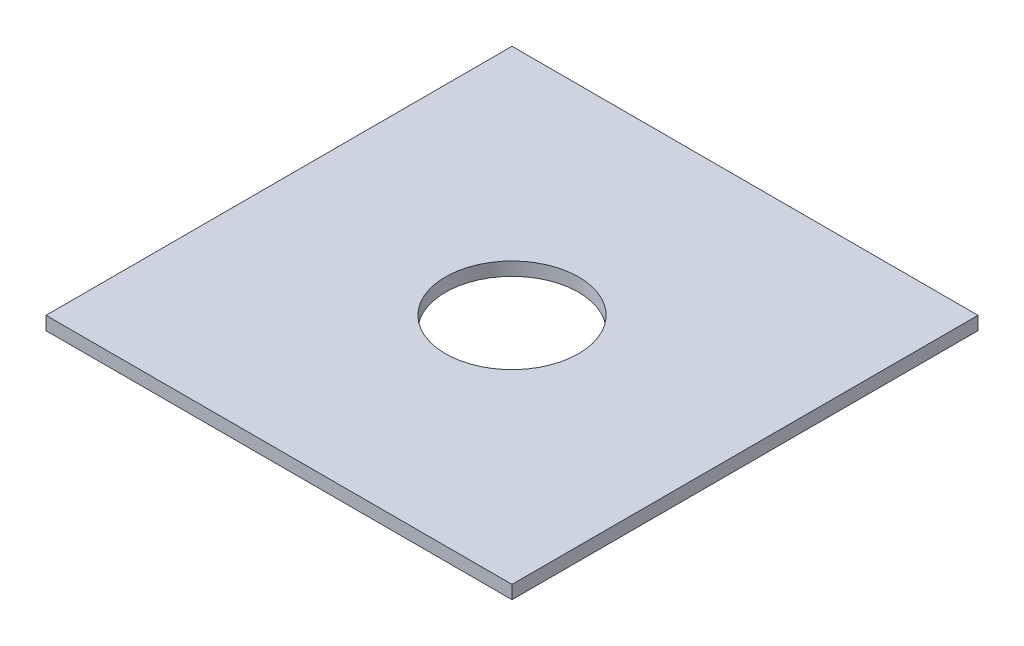
ISO-10303-21;
HEADER;
FILE_DESCRIPTION(('STEP AP214'),'2;1');
FILE_NAME('part.step','',(''),(''),'','','');
FILE_SCHEMA(('AUTOMOTIVE_DESIGN { 1 0 10303 214 1 1 1 1 }'));
ENDSEC;
DATA;
#1=APPLICATION_CONTEXT('core data for automotive mechanical design processes');
#2=APPLICATION_PROTOCOL_DEFINITION('international standard','automotive_design',2000,#1);
#3=PRODUCT_CONTEXT('',#1,'mechanical');
#4=PRODUCT('Part','Part','',(#3));
#5=PRODUCT_RELATED_PRODUCT_CATEGORY('part','',(#4));
#6=PRODUCT_DEFINITION_FORMATION('','',#4);
#7=PRODUCT_DEFINITION_CONTEXT('part definition',#1,'design');
#8=PRODUCT_DEFINITION('design','',#6,#7);
#9=PRODUCT_DEFINITION_SHAPE('','',#8);
#10=(LENGTH_UNIT() NAMED_UNIT(*) SI_UNIT(.MILLI.,.METRE.));
#11=(NAMED_UNIT(*) PLANE_ANGLE_UNIT() SI_UNIT($,.RADIAN.));
#12=(NAMED_UNIT(*) SI_UNIT($,.STERADIAN.) SOLID_ANGLE_UNIT());
#13=UNCERTAINTY_MEASURE_WITH_UNIT(LENGTH_MEASURE(1.E-05),#10,'distance_accuracy_value','');
#14=(GEOMETRIC_REPRESENTATION_CONTEXT(3) GLOBAL_UNCERTAINTY_ASSIGNED_CONTEXT((#13)) GLOBAL_UNIT_ASSIGNED_CONTEXT((#10,
#11,#12)) REPRESENTATION_CONTEXT('',''));
#15=CARTESIAN_POINT('',(0.,0.,0.));
#16=DIRECTION('',(0.,0.,1.));
#17=DIRECTION('',(1.,0.,0.));
#18=AXIS2_PLACEMENT_3D('',#15,#16,#17);
#19=CARTESIAN_POINT('',(0.,10.,0.));
#20=DIRECTION('',(1.,0.,0.));
#21=DIRECTION('',(0.,0.,-1.));
#22=AXIS2_PLACEMENT_3D('',#19,#20,#21);
#23=PLANE('',#22);
#24=DIRECTION('',(0.,0.,1.));
#25=VECTOR('',#24,1.);
#26=CARTESIAN_POINT('',(0.,0.,0.));
#27=LINE('',#26,#25);
#28=CARTESIAN_POINT('',(0.,0.,-350.));
#29=VERTEX_POINT('',#28);
#30=CARTESIAN_POINT('',(0.,0.,0.));
#31=VERTEX_POINT('',#30);
#32=EDGE_CURVE('E94',#29,#31,#27,.T.);
#33=ORIENTED_EDGE('',*,*,#32,.T.);
#34=DIRECTION('',(0.,-1.,0.));
#35=VECTOR('',#34,1.);
#36=CARTESIAN_POINT('',(0.,10.,0.));
#37=LINE('',#36,#35);
#38=CARTESIAN_POINT('',(0.,10.,0.));
#39=VERTEX_POINT('',#38);
#40=EDGE_CURVE('E11',#39,#31,#37,.T.);
#41=ORIENTED_EDGE('',*,*,#40,.F.);
#42=DIRECTION('',(0.,0.,1.));
#43=VECTOR('',#42,1.);
#44=CARTESIAN_POINT('',(0.,10.,0.));
#45=LINE('',#44,#43);
#46=CARTESIAN_POINT('',(0.,10.,-350.));
#47=VERTEX_POINT('',#46);
#48=EDGE_CURVE('E82',#47,#39,#45,.T.);
#49=ORIENTED_EDGE('',*,*,#48,.F.);
#50=DIRECTION('',(0.,-1.,0.));
#51=VECTOR('',#50,1.);
#52=CARTESIAN_POINT('',(0.,10.,-350.));
#53=LINE('',#52,#51);
#54=EDGE_CURVE('E90',#47,#29,#53,.T.);
#55=ORIENTED_EDGE('',*,*,#54,.T.);
#56=EDGE_LOOP('',(#33,#41,#49,#55));
#57=FACE_BOUND('',#56,.T.);
#58=ADVANCED_FACE('F31',(#57),#23,.F.);
#59=CARTESIAN_POINT('',(0.,10.,0.));
#60=DIRECTION('',(0.,0.,-1.));
#61=DIRECTION('',(-1.,0.,0.));
#62=AXIS2_PLACEMENT_3D('',#59,#60,#61);
#63=PLANE('',#62);
#64=DIRECTION('',(1.,0.,0.));
#65=VECTOR('',#64,1.);
#66=CARTESIAN_POINT('',(0.,0.,0.));
#67=LINE('',#66,#65);
#68=CARTESIAN_POINT('',(350.,0.,0.));
#69=VERTEX_POINT('',#68);
#70=EDGE_CURVE('E86',#31,#69,#67,.T.);
#71=ORIENTED_EDGE('',*,*,#70,.T.);
#72=DIRECTION('',(0.,-1.,0.));
#73=VECTOR('',#72,1.);
#74=CARTESIAN_POINT('',(350.,10.,0.));
#75=LINE('',#74,#73);
#76=CARTESIAN_POINT('',(350.,10.,0.));
#77=VERTEX_POINT('',#76);
#78=EDGE_CURVE('E39',#77,#69,#75,.T.);
#79=ORIENTED_EDGE('',*,*,#78,.F.);
#80=DIRECTION('',(1.,0.,0.));
#81=VECTOR('',#80,1.);
#82=CARTESIAN_POINT('',(0.,10.,0.));
#83=LINE('',#82,#81);
#84=EDGE_CURVE('E77',#39,#77,#83,.T.);
#85=ORIENTED_EDGE('',*,*,#84,.F.);
#86=ORIENTED_EDGE('',*,*,#40,.T.);
#87=EDGE_LOOP('',(#71,#79,#85,#86));
#88=FACE_BOUND('',#87,.T.);
#89=ADVANCED_FACE('F85',(#88),#63,.F.);
#90=CARTESIAN_POINT('',(350.,10.,0.));
#91=DIRECTION('',(-1.,0.,0.));
#92=DIRECTION('',(0.,0.,1.));
#93=AXIS2_PLACEMENT_3D('',#90,#91,#92);
#94=PLANE('',#93);
#95=DIRECTION('',(0.,0.,-1.));
#96=VECTOR('',#95,1.);
#97=CARTESIAN_POINT('',(350.,0.,0.));
#98=LINE('',#97,#96);
#99=CARTESIAN_POINT('',(350.,0.,-350.));
#100=VERTEX_POINT('',#99);
#101=EDGE_CURVE('E64',#69,#100,#98,.T.);
#102=ORIENTED_EDGE('',*,*,#101,.T.);
#103=DIRECTION('',(0.,-1.,0.));
#104=VECTOR('',#103,1.);
#105=CARTESIAN_POINT('',(350.,10.,-350.));
#106=LINE('',#105,#104);
#107=CARTESIAN_POINT('',(350.,10.,-350.));
#108=VERTEX_POINT('',#107);
#109=EDGE_CURVE('E87',#108,#100,#106,.T.);
#110=ORIENTED_EDGE('',*,*,#109,.F.);
#111=DIRECTION('',(0.,0.,-1.));
#112=VECTOR('',#111,1.);
#113=CARTESIAN_POINT('',(350.,10.,0.));
#114=LINE('',#113,#112);
#115=EDGE_CURVE('E80',#77,#108,#114,.T.);
#116=ORIENTED_EDGE('',*,*,#115,.F.);
#117=ORIENTED_EDGE('',*,*,#78,.T.);
#118=EDGE_LOOP('',(#102,#110,#116,#117));
#119=FACE_BOUND('',#118,.T.);
#120=ADVANCED_FACE('F88',(#119),#94,.F.);
#121=CARTESIAN_POINT('',(0.,10.,-350.));
#122=DIRECTION('',(0.,0.,1.));
#123=DIRECTION('',(1.,0.,0.));
#124=AXIS2_PLACEMENT_3D('',#121,#122,#123);
#125=PLANE('',#124);
#126=DIRECTION('',(-1.,0.,0.));
#127=VECTOR('',#126,1.);
#128=CARTESIAN_POINT('',(0.,0.,-350.));
#129=LINE('',#128,#127);
#130=EDGE_CURVE('E70',#100,#29,#129,.T.);
#131=ORIENTED_EDGE('',*,*,#130,.T.);
#132=ORIENTED_EDGE('',*,*,#54,.F.);
#133=DIRECTION('',(-1.,0.,0.));
#134=VECTOR('',#133,1.);
#135=CARTESIAN_POINT('',(0.,10.,-350.));
#136=LINE('',#135,#134);
#137=EDGE_CURVE('E47',#108,#47,#136,.T.);
#138=ORIENTED_EDGE('',*,*,#137,.F.);
#139=ORIENTED_EDGE('',*,*,#109,.T.);
#140=EDGE_LOOP('',(#131,#132,#138,#139));
#141=FACE_BOUND('',#140,.T.);
#142=ADVANCED_FACE('F102',(#141),#125,.F.);
#143=CARTESIAN_POINT('',(0.,10.,-350.));
#144=DIRECTION('',(0.,-1.,0.));
#145=DIRECTION('',(0.,0.,-1.));
#146=AXIS2_PLACEMENT_3D('',#143,#144,#145);
#147=PLANE('',#146);
#148=CARTESIAN_POINT('',(175.,10.,-175.));
#149=DIRECTION('',(0.,1.,0.));
#150=DIRECTION('',(1.,0.,0.));
#151=AXIS2_PLACEMENT_3D('',#148,#149,#150);
#152=CIRCLE('',#151,50.);
#153=CARTESIAN_POINT('',(225.,10.,-175.));
#154=VERTEX_POINT('',#153);
#155=EDGE_CURVE('E108',#154,#154,#152,.T.);
#156=ORIENTED_EDGE('',*,*,#155,.F.);
#157=EDGE_LOOP('',(#156));
#158=FACE_BOUND('',#157,.T.);
#159=ORIENTED_EDGE('',*,*,#48,.T.);
#160=ORIENTED_EDGE('',*,*,#84,.T.);
#161=ORIENTED_EDGE('',*,*,#115,.T.);
#162=ORIENTED_EDGE('',*,*,#137,.T.);
#163=EDGE_LOOP('',(#159,#160,#161,#162));
#164=FACE_BOUND('',#163,.T.);
#165=ADVANCED_FACE('F78',(#158,#164),#147,.F.);
#166=CARTESIAN_POINT('',(0.,0.,-350.));
#167=DIRECTION('',(0.,-1.,0.));
#168=DIRECTION('',(0.,0.,-1.));
#169=AXIS2_PLACEMENT_3D('',#166,#167,#168);
#170=PLANE('',#169);
#171=CARTESIAN_POINT('',(175.,0.,-175.));
#172=DIRECTION('',(0.,1.,0.));
#173=DIRECTION('',(1.,0.,0.));
#174=AXIS2_PLACEMENT_3D('',#171,#172,#173);
#175=CIRCLE('',#174,50.);
#176=CARTESIAN_POINT('',(225.,0.,-175.));
#177=VERTEX_POINT('',#176);
#178=EDGE_CURVE('E97',#177,#177,#175,.T.);
#179=ORIENTED_EDGE('',*,*,#178,.T.);
#180=EDGE_LOOP('',(#179));
#181=FACE_BOUND('',#180,.T.);
#182=ORIENTED_EDGE('',*,*,#32,.F.);
#183=ORIENTED_EDGE('',*,*,#130,.F.);
#184=ORIENTED_EDGE('',*,*,#101,.F.);
#185=ORIENTED_EDGE('',*,*,#70,.F.);
#186=EDGE_LOOP('',(#182,#183,#184,#185));
#187=FACE_BOUND('',#186,.T.);
#188=ADVANCED_FACE('F105',(#181,#187),#170,.T.);
#189=CARTESIAN_POINT('',(175.,0.,-175.));
#190=DIRECTION('',(0.,1.,0.));
#191=DIRECTION('',(0.,0.,1.));
#192=AXIS2_PLACEMENT_3D('',#189,#190,#191);
#193=CYLINDRICAL_SURFACE('',#192,50.);
#194=ORIENTED_EDGE('',*,*,#178,.F.);
#195=EDGE_LOOP('',(#194));
#196=FACE_BOUND('',#195,.T.);
#197=ORIENTED_EDGE('',*,*,#155,.T.);
#198=EDGE_LOOP('',(#197));
#199=FACE_BOUND('',#198,.T.);
#200=ADVANCED_FACE('F115',(#196,#199),#193,.F.);
#201=CLOSED_SHELL('',(#58,#89,#120,#142,#165,#188,#200));
#202=MANIFOLD_SOLID_BREP('B2',#201);
#203=ADVANCED_BREP_SHAPE_REPRESENTATION('',(#18,#202),#14);
#204=SHAPE_DEFINITION_REPRESENTATION(#9,#203);
ENDSEC;
END-ISO-10303-21;
